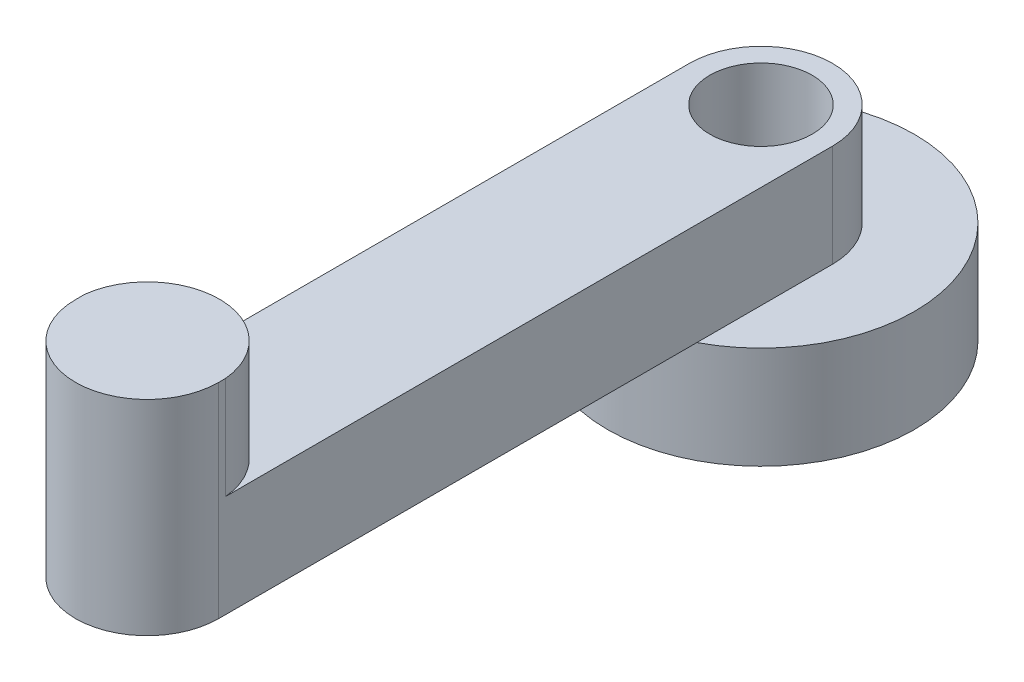
ISO-10303-21;
HEADER;
FILE_DESCRIPTION(('STEP AP214'),'2;1');
FILE_NAME('part.step','',(''),(''),'','','');
FILE_SCHEMA(('AUTOMOTIVE_DESIGN { 1 0 10303 214 1 1 1 1 }'));
ENDSEC;
DATA;
#1=APPLICATION_CONTEXT('core data for automotive mechanical design processes');
#2=APPLICATION_PROTOCOL_DEFINITION('international standard','automotive_design',2000,#1);
#3=PRODUCT_CONTEXT('',#1,'mechanical');
#4=PRODUCT('Part','Part','',(#3));
#5=PRODUCT_RELATED_PRODUCT_CATEGORY('part','',(#4));
#6=PRODUCT_DEFINITION_FORMATION('','',#4);
#7=PRODUCT_DEFINITION_CONTEXT('part definition',#1,'design');
#8=PRODUCT_DEFINITION('design','',#6,#7);
#9=PRODUCT_DEFINITION_SHAPE('','',#8);
#10=(LENGTH_UNIT() NAMED_UNIT(*) SI_UNIT(.MILLI.,.METRE.));
#11=(NAMED_UNIT(*) PLANE_ANGLE_UNIT() SI_UNIT($,.RADIAN.));
#12=(NAMED_UNIT(*) SI_UNIT($,.STERADIAN.) SOLID_ANGLE_UNIT());
#13=UNCERTAINTY_MEASURE_WITH_UNIT(LENGTH_MEASURE(1.E-05),#10,'distance_accuracy_value','');
#14=(GEOMETRIC_REPRESENTATION_CONTEXT(3) GLOBAL_UNCERTAINTY_ASSIGNED_CONTEXT((#13)) GLOBAL_UNIT_ASSIGNED_CONTEXT((#10,
#11,#12)) REPRESENTATION_CONTEXT('',''));
#15=CARTESIAN_POINT('',(0.,0.,0.));
#16=DIRECTION('',(0.,0.,1.));
#17=DIRECTION('',(1.,0.,0.));
#18=AXIS2_PLACEMENT_3D('',#15,#16,#17);
#19=CARTESIAN_POINT('',(0.,50.,0.));
#20=DIRECTION('',(0.,-1.,0.));
#21=DIRECTION('',(0.,0.,-1.));
#22=AXIS2_PLACEMENT_3D('',#19,#20,#21);
#23=CYLINDRICAL_SURFACE('',#22,75.);
#24=CARTESIAN_POINT('',(0.,50.,0.));
#25=DIRECTION('',(0.,1.,0.));
#26=DIRECTION('',(0.,0.,1.));
#27=AXIS2_PLACEMENT_3D('',#24,#25,#26);
#28=CIRCLE('',#27,75.);
#29=CARTESIAN_POINT('',(35.,50.,66.332495807108));
#30=VERTEX_POINT('',#29);
#31=CARTESIAN_POINT('',(-35.,50.,66.332495807108));
#32=VERTEX_POINT('',#31);
#33=EDGE_CURVE('E48',#30,#32,#28,.T.);
#34=ORIENTED_EDGE('',*,*,#33,.F.);
#35=EDGE_CURVE('E170',#32,#30,#28,.T.);
#36=ORIENTED_EDGE('',*,*,#35,.F.);
#37=EDGE_LOOP('',(#34,#36));
#38=FACE_BOUND('',#37,.T.);
#39=CARTESIAN_POINT('',(0.,0.,0.));
#40=DIRECTION('',(0.,1.,0.));
#41=DIRECTION('',(0.,0.,1.));
#42=AXIS2_PLACEMENT_3D('',#39,#40,#41);
#43=CIRCLE('',#42,75.);
#44=CARTESIAN_POINT('',(0.,0.,75.));
#45=VERTEX_POINT('',#44);
#46=EDGE_CURVE('E168',#45,#45,#43,.T.);
#47=ORIENTED_EDGE('',*,*,#46,.T.);
#48=EDGE_LOOP('',(#47));
#49=FACE_BOUND('',#48,.T.);
#50=ADVANCED_FACE('F39',(#38,#49),#23,.T.);
#51=CARTESIAN_POINT('',(0.,50.,0.));
#52=DIRECTION('',(0.,1.,0.));
#53=DIRECTION('',(0.,0.,1.));
#54=AXIS2_PLACEMENT_3D('',#51,#52,#53);
#55=PLANE('',#54);
#56=DIRECTION('',(0.,0.,-1.));
#57=VECTOR('',#56,1.);
#58=CARTESIAN_POINT('',(35.,50.,0.));
#59=LINE('',#58,#57);
#60=CARTESIAN_POINT('',(35.,50.,0.));
#61=VERTEX_POINT('',#60);
#62=EDGE_CURVE('E11',#30,#61,#59,.T.);
#63=ORIENTED_EDGE('',*,*,#62,.F.);
#64=ORIENTED_EDGE('',*,*,#33,.T.);
#65=DIRECTION('',(0.,0.,1.));
#66=VECTOR('',#65,1.);
#67=CARTESIAN_POINT('',(-35.,50.,0.));
#68=LINE('',#67,#66);
#69=CARTESIAN_POINT('',(-35.,50.,0.));
#70=VERTEX_POINT('',#69);
#71=EDGE_CURVE('E146',#70,#32,#68,.T.);
#72=ORIENTED_EDGE('',*,*,#71,.F.);
#73=CARTESIAN_POINT('',(0.,50.,0.));
#74=DIRECTION('',(0.,1.,0.));
#75=DIRECTION('',(0.,0.,1.));
#76=AXIS2_PLACEMENT_3D('',#73,#74,#75);
#77=CIRCLE('',#76,35.);
#78=EDGE_CURVE('E65',#61,#70,#77,.T.);
#79=ORIENTED_EDGE('',*,*,#78,.F.);
#80=EDGE_LOOP('',(#63,#64,#72,#79));
#81=FACE_BOUND('',#80,.T.);
#82=ADVANCED_FACE('F209',(#81),#55,.T.);
#83=CARTESIAN_POINT('',(0.,0.,0.));
#84=DIRECTION('',(0.,1.,0.));
#85=DIRECTION('',(0.,0.,1.));
#86=AXIS2_PLACEMENT_3D('',#83,#84,#85);
#87=PLANE('',#86);
#88=CARTESIAN_POINT('',(0.,0.,0.));
#89=DIRECTION('',(0.,-1.,0.));
#90=DIRECTION('',(0.,0.,-1.));
#91=AXIS2_PLACEMENT_3D('',#88,#89,#90);
#92=CIRCLE('',#91,25.);
#93=CARTESIAN_POINT('',(0.,0.,-25.));
#94=VERTEX_POINT('',#93);
#95=EDGE_CURVE('E196',#94,#94,#92,.T.);
#96=ORIENTED_EDGE('',*,*,#95,.F.);
#97=EDGE_LOOP('',(#96));
#98=FACE_BOUND('',#97,.T.);
#99=ORIENTED_EDGE('',*,*,#46,.F.);
#100=EDGE_LOOP('',(#99));
#101=FACE_BOUND('',#100,.T.);
#102=ADVANCED_FACE('F206',(#98,#101),#87,.F.);
#103=CARTESIAN_POINT('',(0.,50.,0.));
#104=DIRECTION('',(0.,1.,0.));
#105=DIRECTION('',(0.,0.,1.));
#106=AXIS2_PLACEMENT_3D('',#103,#104,#105);
#107=PLANE('',#106);
#108=CARTESIAN_POINT('',(-35.,50.,300.));
#109=VERTEX_POINT('',#108);
#110=EDGE_CURVE('E131',#32,#109,#68,.T.);
#111=ORIENTED_EDGE('',*,*,#110,.F.);
#112=ORIENTED_EDGE('',*,*,#35,.T.);
#113=CARTESIAN_POINT('',(35.,50.,300.));
#114=VERTEX_POINT('',#113);
#115=EDGE_CURVE('E50',#114,#30,#59,.T.);
#116=ORIENTED_EDGE('',*,*,#115,.F.);
#117=CARTESIAN_POINT('',(0.,50.,300.));
#118=DIRECTION('',(0.,1.,0.));
#119=DIRECTION('',(0.,0.,1.));
#120=AXIS2_PLACEMENT_3D('',#117,#118,#119);
#121=CIRCLE('',#120,35.);
#122=EDGE_CURVE('E150',#109,#114,#121,.T.);
#123=ORIENTED_EDGE('',*,*,#122,.F.);
#124=EDGE_LOOP('',(#111,#112,#116,#123));
#125=FACE_BOUND('',#124,.T.);
#126=ADVANCED_FACE('F181',(#125),#107,.F.);
#127=CARTESIAN_POINT('',(0.,100.,0.));
#128=DIRECTION('',(0.,-1.,0.));
#129=DIRECTION('',(0.,0.,-1.));
#130=AXIS2_PLACEMENT_3D('',#127,#128,#129);
#131=CYLINDRICAL_SURFACE('',#130,35.);
#132=ORIENTED_EDGE('',*,*,#78,.T.);
#133=DIRECTION('',(0.,-1.,0.));
#134=VECTOR('',#133,1.);
#135=CARTESIAN_POINT('',(-35.,100.,0.));
#136=LINE('',#135,#134);
#137=CARTESIAN_POINT('',(-35.,100.,0.));
#138=VERTEX_POINT('',#137);
#139=EDGE_CURVE('E164',#138,#70,#136,.T.);
#140=ORIENTED_EDGE('',*,*,#139,.F.);
#141=CARTESIAN_POINT('',(0.,100.,0.));
#142=DIRECTION('',(0.,1.,0.));
#143=DIRECTION('',(0.,0.,1.));
#144=AXIS2_PLACEMENT_3D('',#141,#142,#143);
#145=CIRCLE('',#144,35.);
#146=CARTESIAN_POINT('',(35.,100.,0.));
#147=VERTEX_POINT('',#146);
#148=EDGE_CURVE('E136',#147,#138,#145,.T.);
#149=ORIENTED_EDGE('',*,*,#148,.F.);
#150=DIRECTION('',(0.,-1.,0.));
#151=VECTOR('',#150,1.);
#152=CARTESIAN_POINT('',(35.,100.,0.));
#153=LINE('',#152,#151);
#154=EDGE_CURVE('E144',#147,#61,#153,.T.);
#155=ORIENTED_EDGE('',*,*,#154,.T.);
#156=EDGE_LOOP('',(#132,#140,#149,#155));
#157=FACE_BOUND('',#156,.T.);
#158=ADVANCED_FACE('F215',(#157),#131,.T.);
#159=CARTESIAN_POINT('',(-35.,100.,0.));
#160=DIRECTION('',(1.,0.,0.));
#161=DIRECTION('',(0.,0.,-1.));
#162=AXIS2_PLACEMENT_3D('',#159,#160,#161);
#163=PLANE('',#162);
#164=ORIENTED_EDGE('',*,*,#71,.T.);
#165=ORIENTED_EDGE('',*,*,#110,.T.);
#166=DIRECTION('',(0.,-1.,0.));
#167=VECTOR('',#166,1.);
#168=CARTESIAN_POINT('',(-35.,100.,300.));
#169=LINE('',#168,#167);
#170=CARTESIAN_POINT('',(-35.,150.,300.));
#171=VERTEX_POINT('',#170);
#172=EDGE_CURVE('E160',#171,#109,#169,.T.);
#173=ORIENTED_EDGE('',*,*,#172,.F.);
#174=DIRECTION('',(0.,0.,1.));
#175=VECTOR('',#174,1.);
#176=CARTESIAN_POINT('',(-35.,150.,0.));
#177=LINE('',#176,#175);
#178=CARTESIAN_POINT('',(-35.,150.,295.337619389626));
#179=VERTEX_POINT('',#178);
#180=EDGE_CURVE('E111',#179,#171,#177,.T.);
#181=ORIENTED_EDGE('',*,*,#180,.F.);
#182=DIRECTION('',(0.,-1.,0.));
#183=VECTOR('',#182,1.);
#184=CARTESIAN_POINT('',(-35.,150.,295.337619389626));
#185=LINE('',#184,#183);
#186=CARTESIAN_POINT('',(-35.,100.,295.337619389626));
#187=VERTEX_POINT('',#186);
#188=EDGE_CURVE('E106',#179,#187,#185,.T.);
#189=ORIENTED_EDGE('',*,*,#188,.T.);
#190=DIRECTION('',(0.,0.,1.));
#191=VECTOR('',#190,1.);
#192=CARTESIAN_POINT('',(-35.,100.,0.));
#193=LINE('',#192,#191);
#194=EDGE_CURVE('E140',#138,#187,#193,.T.);
#195=ORIENTED_EDGE('',*,*,#194,.F.);
#196=ORIENTED_EDGE('',*,*,#139,.T.);
#197=EDGE_LOOP('',(#164,#165,#173,#181,#189,#195,#196));
#198=FACE_BOUND('',#197,.T.);
#199=ADVANCED_FACE('F188',(#198),#163,.F.);
#200=CARTESIAN_POINT('',(0.,100.,300.));
#201=DIRECTION('',(0.,-1.,0.));
#202=DIRECTION('',(0.,0.,-1.));
#203=AXIS2_PLACEMENT_3D('',#200,#201,#202);
#204=CYLINDRICAL_SURFACE('',#203,35.);
#205=ORIENTED_EDGE('',*,*,#122,.T.);
#206=DIRECTION('',(0.,-1.,0.));
#207=VECTOR('',#206,1.);
#208=CARTESIAN_POINT('',(35.,100.,300.));
#209=LINE('',#208,#207);
#210=CARTESIAN_POINT('',(35.,150.,300.));
#211=VERTEX_POINT('',#210);
#212=EDGE_CURVE('E157',#211,#114,#209,.T.);
#213=ORIENTED_EDGE('',*,*,#212,.F.);
#214=CARTESIAN_POINT('',(0.,150.,300.));
#215=DIRECTION('',(0.,1.,0.));
#216=DIRECTION('',(0.,0.,1.));
#217=AXIS2_PLACEMENT_3D('',#214,#215,#216);
#218=CIRCLE('',#217,35.);
#219=EDGE_CURVE('E118',#171,#211,#218,.T.);
#220=ORIENTED_EDGE('',*,*,#219,.F.);
#221=ORIENTED_EDGE('',*,*,#172,.T.);
#222=EDGE_LOOP('',(#205,#213,#220,#221));
#223=FACE_BOUND('',#222,.T.);
#224=ADVANCED_FACE('F186',(#223),#204,.T.);
#225=CARTESIAN_POINT('',(35.,100.,0.));
#226=DIRECTION('',(-1.,0.,0.));
#227=DIRECTION('',(0.,0.,1.));
#228=AXIS2_PLACEMENT_3D('',#225,#226,#227);
#229=PLANE('',#228);
#230=ORIENTED_EDGE('',*,*,#115,.T.);
#231=ORIENTED_EDGE('',*,*,#62,.T.);
#232=ORIENTED_EDGE('',*,*,#154,.F.);
#233=DIRECTION('',(0.,0.,-1.));
#234=VECTOR('',#233,1.);
#235=CARTESIAN_POINT('',(35.,100.,0.));
#236=LINE('',#235,#234);
#237=CARTESIAN_POINT('',(35.,100.,296.670788491841));
#238=VERTEX_POINT('',#237);
#239=EDGE_CURVE('E126',#238,#147,#236,.T.);
#240=ORIENTED_EDGE('',*,*,#239,.F.);
#241=DIRECTION('',(0.,-1.,0.));
#242=VECTOR('',#241,1.);
#243=CARTESIAN_POINT('',(35.,150.,296.670788491841));
#244=LINE('',#243,#242);
#245=CARTESIAN_POINT('',(35.,150.,296.670788491841));
#246=VERTEX_POINT('',#245);
#247=EDGE_CURVE('E104',#246,#238,#244,.T.);
#248=ORIENTED_EDGE('',*,*,#247,.F.);
#249=DIRECTION('',(0.,0.,-1.));
#250=VECTOR('',#249,1.);
#251=CARTESIAN_POINT('',(35.,150.,0.));
#252=LINE('',#251,#250);
#253=EDGE_CURVE('E112',#211,#246,#252,.T.);
#254=ORIENTED_EDGE('',*,*,#253,.F.);
#255=ORIENTED_EDGE('',*,*,#212,.T.);
#256=EDGE_LOOP('',(#230,#231,#232,#240,#248,#254,#255));
#257=FACE_BOUND('',#256,.T.);
#258=ADVANCED_FACE('F124',(#257),#229,.F.);
#259=CARTESIAN_POINT('',(0.,100.,0.));
#260=DIRECTION('',(0.,1.,0.));
#261=DIRECTION('',(0.,0.,1.));
#262=AXIS2_PLACEMENT_3D('',#259,#260,#261);
#263=PLANE('',#262);
#264=CARTESIAN_POINT('',(0.,100.,0.));
#265=DIRECTION('',(0.,1.,0.));
#266=DIRECTION('',(0.,0.,1.));
#267=AXIS2_PLACEMENT_3D('',#264,#265,#266);
#268=CIRCLE('',#267,25.);
#269=CARTESIAN_POINT('',(0.,100.,25.));
#270=VERTEX_POINT('',#269);
#271=EDGE_CURVE('E42',#270,#270,#268,.T.);
#272=ORIENTED_EDGE('',*,*,#271,.F.);
#273=EDGE_LOOP('',(#272));
#274=FACE_BOUND('',#273,.T.);
#275=CARTESIAN_POINT('',(-0.0723112128119983,100.,299.801010278675));
#276=DIRECTION('',(0.,1.,0.));
#277=DIRECTION('',(0.,0.,1.));
#278=AXIS2_PLACEMENT_3D('',#275,#276,#277);
#279=CIRCLE('',#278,35.2117210917488);
#280=EDGE_CURVE('E57',#238,#187,#279,.T.);
#281=ORIENTED_EDGE('',*,*,#280,.F.);
#282=ORIENTED_EDGE('',*,*,#239,.T.);
#283=ORIENTED_EDGE('',*,*,#148,.T.);
#284=ORIENTED_EDGE('',*,*,#194,.T.);
#285=EDGE_LOOP('',(#281,#282,#283,#284));
#286=FACE_BOUND('',#285,.T.);
#287=ADVANCED_FACE('F225',(#274,#286),#263,.T.);
#288=CARTESIAN_POINT('',(-0.0723112128119983,150.,299.801010278675));
#289=DIRECTION('',(0.,-1.,0.));
#290=DIRECTION('',(0.,0.,-1.));
#291=AXIS2_PLACEMENT_3D('',#288,#289,#290);
#292=CYLINDRICAL_SURFACE('',#291,35.2117210917488);
#293=ORIENTED_EDGE('',*,*,#280,.T.);
#294=ORIENTED_EDGE('',*,*,#188,.F.);
#295=CARTESIAN_POINT('',(-0.0723112128119983,150.,299.801010278675));
#296=DIRECTION('',(0.,1.,0.));
#297=DIRECTION('',(0.,0.,1.));
#298=AXIS2_PLACEMENT_3D('',#295,#296,#297);
#299=CIRCLE('',#298,35.2117210917488);
#300=EDGE_CURVE('E100',#246,#179,#299,.T.);
#301=ORIENTED_EDGE('',*,*,#300,.F.);
#302=ORIENTED_EDGE('',*,*,#247,.T.);
#303=EDGE_LOOP('',(#293,#294,#301,#302));
#304=FACE_BOUND('',#303,.T.);
#305=ADVANCED_FACE('F102',(#304),#292,.T.);
#306=CARTESIAN_POINT('',(0.,150.,0.));
#307=DIRECTION('',(0.,1.,0.));
#308=DIRECTION('',(0.,0.,1.));
#309=AXIS2_PLACEMENT_3D('',#306,#307,#308);
#310=PLANE('',#309);
#311=ORIENTED_EDGE('',*,*,#253,.T.);
#312=ORIENTED_EDGE('',*,*,#300,.T.);
#313=ORIENTED_EDGE('',*,*,#180,.T.);
#314=ORIENTED_EDGE('',*,*,#219,.T.);
#315=EDGE_LOOP('',(#311,#312,#313,#314));
#316=FACE_BOUND('',#315,.T.);
#317=ADVANCED_FACE('F116',(#316),#310,.T.);
#318=CARTESIAN_POINT('',(0.,150.,0.));
#319=DIRECTION('',(0.,-1.,0.));
#320=DIRECTION('',(0.,0.,-1.));
#321=AXIS2_PLACEMENT_3D('',#318,#319,#320);
#322=CYLINDRICAL_SURFACE('',#321,25.);
#323=ORIENTED_EDGE('',*,*,#271,.T.);
#324=EDGE_LOOP('',(#323));
#325=FACE_BOUND('',#324,.T.);
#326=ORIENTED_EDGE('',*,*,#95,.T.);
#327=EDGE_LOOP('',(#326));
#328=FACE_BOUND('',#327,.T.);
#329=ADVANCED_FACE('F204',(#325,#328),#322,.F.);
#330=CLOSED_SHELL('',(#50,#82,#102,#126,#158,#199,#224,#258,#287,#305,#317,#329));
#331=MANIFOLD_SOLID_BREP('B2',#330);
#332=ADVANCED_BREP_SHAPE_REPRESENTATION('',(#18,#331),#14);
#333=SHAPE_DEFINITION_REPRESENTATION(#9,#332);
ENDSEC;
END-ISO-10303-21;
